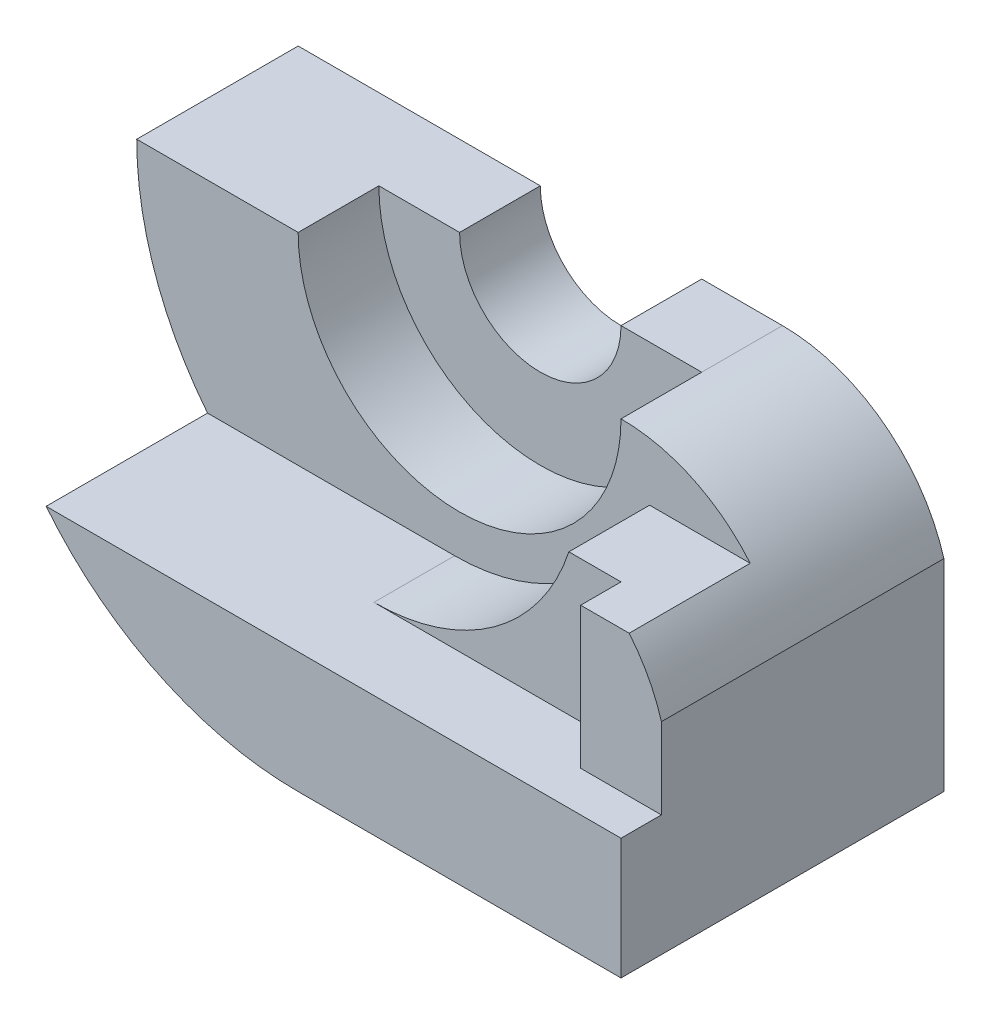
ISO-10303-21;
HEADER;
FILE_DESCRIPTION(('STEP AP214'),'2;1');
FILE_NAME('part.step','',(''),(''),'','','');
FILE_SCHEMA(('AUTOMOTIVE_DESIGN { 1 0 10303 214 1 1 1 1 }'));
ENDSEC;
DATA;
#1=APPLICATION_CONTEXT('core data for automotive mechanical design processes');
#2=APPLICATION_PROTOCOL_DEFINITION('international standard','automotive_design',2000,#1);
#3=PRODUCT_CONTEXT('',#1,'mechanical');
#4=PRODUCT('Part','Part','',(#3));
#5=PRODUCT_RELATED_PRODUCT_CATEGORY('part','',(#4));
#6=PRODUCT_DEFINITION_FORMATION('','',#4);
#7=PRODUCT_DEFINITION_CONTEXT('part definition',#1,'design');
#8=PRODUCT_DEFINITION('design','',#6,#7);
#9=PRODUCT_DEFINITION_SHAPE('','',#8);
#10=(LENGTH_UNIT() NAMED_UNIT(*) SI_UNIT(.MILLI.,.METRE.));
#11=(NAMED_UNIT(*) PLANE_ANGLE_UNIT() SI_UNIT($,.RADIAN.));
#12=(NAMED_UNIT(*) SI_UNIT($,.STERADIAN.) SOLID_ANGLE_UNIT());
#13=UNCERTAINTY_MEASURE_WITH_UNIT(LENGTH_MEASURE(1.E-05),#10,'distance_accuracy_value','');
#14=(GEOMETRIC_REPRESENTATION_CONTEXT(3) GLOBAL_UNCERTAINTY_ASSIGNED_CONTEXT((#13)) GLOBAL_UNIT_ASSIGNED_CONTEXT((#10,
#11,#12)) REPRESENTATION_CONTEXT('',''));
#15=CARTESIAN_POINT('',(0.,0.,0.));
#16=DIRECTION('',(0.,0.,1.));
#17=DIRECTION('',(1.,0.,0.));
#18=AXIS2_PLACEMENT_3D('',#15,#16,#17);
#19=CARTESIAN_POINT('',(0.,0.,80.));
#20=DIRECTION('',(0.,0.,-1.));
#21=DIRECTION('',(-1.,0.,0.));
#22=AXIS2_PLACEMENT_3D('',#19,#20,#21);
#23=CYLINDRICAL_SURFACE('',#22,40.);
#24=CARTESIAN_POINT('',(0.,0.,40.));
#25=DIRECTION('',(0.,0.,1.));
#26=DIRECTION('',(1.,0.,0.));
#27=AXIS2_PLACEMENT_3D('',#24,#25,#26);
#28=CIRCLE('',#27,40.);
#29=CARTESIAN_POINT('',(40.,0.,40.));
#30=VERTEX_POINT('',#29);
#31=CARTESIAN_POINT('',(-40.,0.,40.));
#32=VERTEX_POINT('',#31);
#33=EDGE_CURVE('E175',#30,#32,#28,.F.);
#34=ORIENTED_EDGE('',*,*,#33,.F.);
#35=DIRECTION('',(0.,0.,-1.));
#36=VECTOR('',#35,1.);
#37=CARTESIAN_POINT('',(40.,0.,80.));
#38=LINE('',#37,#36);
#39=CARTESIAN_POINT('',(40.,0.,20.));
#40=VERTEX_POINT('',#39);
#41=EDGE_CURVE('E234',#30,#40,#38,.T.);
#42=ORIENTED_EDGE('',*,*,#41,.T.);
#43=CARTESIAN_POINT('',(0.,0.,20.));
#44=DIRECTION('',(0.,0.,-1.));
#45=DIRECTION('',(-1.,0.,0.));
#46=AXIS2_PLACEMENT_3D('',#43,#44,#45);
#47=CIRCLE('',#46,40.);
#48=CARTESIAN_POINT('',(-40.,0.,20.));
#49=VERTEX_POINT('',#48);
#50=EDGE_CURVE('E191',#49,#40,#47,.F.);
#51=ORIENTED_EDGE('',*,*,#50,.F.);
#52=DIRECTION('',(0.,0.,-1.));
#53=VECTOR('',#52,1.);
#54=CARTESIAN_POINT('',(-40.,0.,80.));
#55=LINE('',#54,#53);
#56=EDGE_CURVE('E232',#32,#49,#55,.T.);
#57=ORIENTED_EDGE('',*,*,#56,.F.);
#58=EDGE_LOOP('',(#34,#42,#51,#57));
#59=FACE_BOUND('',#58,.T.);
#60=ADVANCED_FACE('F34',(#59),#23,.F.);
#61=CARTESIAN_POINT('',(40.,-41.6666666666667,80.));
#62=DIRECTION('',(0.,0.,-1.));
#63=DIRECTION('',(-1.,0.,0.));
#64=AXIS2_PLACEMENT_3D('',#61,#62,#63);
#65=CYLINDRICAL_SURFACE('',#64,41.6666666666667);
#66=DIRECTION('',(0.,0.,-1.));
#67=VECTOR('',#66,1.);
#68=CARTESIAN_POINT('',(72.0156211871643,-15.,80.));
#69=LINE('',#68,#67);
#70=CARTESIAN_POINT('',(72.0156211871643,-15.,70.));
#71=VERTEX_POINT('',#70);
#72=CARTESIAN_POINT('',(72.0156211871643,-15.,40.));
#73=VERTEX_POINT('',#72);
#74=EDGE_CURVE('E165',#71,#73,#69,.T.);
#75=ORIENTED_EDGE('',*,*,#74,.F.);
#76=CARTESIAN_POINT('',(40.,-41.6666666666667,70.));
#77=DIRECTION('',(0.,0.,1.));
#78=DIRECTION('',(1.,0.,0.));
#79=AXIS2_PLACEMENT_3D('',#76,#77,#78);
#80=CIRCLE('',#79,41.6666666666667);
#81=CARTESIAN_POINT('',(80.,-30.,70.));
#82=VERTEX_POINT('',#81);
#83=EDGE_CURVE('E260',#82,#71,#80,.T.);
#84=ORIENTED_EDGE('',*,*,#83,.F.);
#85=DIRECTION('',(0.,0.,-1.));
#86=VECTOR('',#85,1.);
#87=CARTESIAN_POINT('',(80.,-30.,80.));
#88=LINE('',#87,#86);
#89=CARTESIAN_POINT('',(80.,-30.,0.));
#90=VERTEX_POINT('',#89);
#91=EDGE_CURVE('E236',#82,#90,#88,.T.);
#92=ORIENTED_EDGE('',*,*,#91,.T.);
#93=CARTESIAN_POINT('',(40.,-41.6666666666667,0.));
#94=DIRECTION('',(0.,0.,1.));
#95=DIRECTION('',(1.,0.,0.));
#96=AXIS2_PLACEMENT_3D('',#93,#94,#95);
#97=CIRCLE('',#96,41.6666666666667);
#98=CARTESIAN_POINT('',(40.,0.,0.));
#99=VERTEX_POINT('',#98);
#100=EDGE_CURVE('E218',#90,#99,#97,.T.);
#101=ORIENTED_EDGE('',*,*,#100,.T.);
#102=DIRECTION('',(0.,0.,-1.));
#103=VECTOR('',#102,1.);
#104=CARTESIAN_POINT('',(40.,0.,20.));
#105=LINE('',#104,#103);
#106=EDGE_CURVE('E199',#40,#99,#105,.T.);
#107=ORIENTED_EDGE('',*,*,#106,.F.);
#108=ORIENTED_EDGE('',*,*,#41,.F.);
#109=CARTESIAN_POINT('',(40.,-41.6666666666667,40.));
#110=DIRECTION('',(0.,0.,1.));
#111=DIRECTION('',(1.,0.,0.));
#112=AXIS2_PLACEMENT_3D('',#109,#110,#111);
#113=CIRCLE('',#112,41.6666666666667);
#114=EDGE_CURVE('E168',#73,#30,#113,.T.);
#115=ORIENTED_EDGE('',*,*,#114,.F.);
#116=EDGE_LOOP('',(#75,#84,#92,#101,#107,#108,#115));
#117=FACE_BOUND('',#116,.T.);
#118=ADVANCED_FACE('F291',(#117),#65,.T.);
#119=CARTESIAN_POINT('',(0.,0.,80.));
#120=DIRECTION('',(0.,1.,0.));
#121=DIRECTION('',(0.,0.,1.));
#122=AXIS2_PLACEMENT_3D('',#119,#120,#121);
#123=PLANE('',#122);
#124=DIRECTION('',(0.,0.,-1.));
#125=VECTOR('',#124,1.);
#126=CARTESIAN_POINT('',(-80.,0.,80.));
#127=LINE('',#126,#125);
#128=CARTESIAN_POINT('',(-80.,0.,40.));
#129=VERTEX_POINT('',#128);
#130=CARTESIAN_POINT('',(-80.,0.,0.));
#131=VERTEX_POINT('',#130);
#132=EDGE_CURVE('E230',#129,#131,#127,.T.);
#133=ORIENTED_EDGE('',*,*,#132,.F.);
#134=DIRECTION('',(-1.,0.,0.));
#135=VECTOR('',#134,1.);
#136=CARTESIAN_POINT('',(142.,0.,40.));
#137=LINE('',#136,#135);
#138=EDGE_CURVE('E166',#32,#129,#137,.T.);
#139=ORIENTED_EDGE('',*,*,#138,.F.);
#140=ORIENTED_EDGE('',*,*,#56,.T.);
#141=DIRECTION('',(-1.,0.,0.));
#142=VECTOR('',#141,1.);
#143=CARTESIAN_POINT('',(0.,0.,20.));
#144=LINE('',#143,#142);
#145=CARTESIAN_POINT('',(-20.,0.,20.));
#146=VERTEX_POINT('',#145);
#147=EDGE_CURVE('E181',#146,#49,#144,.T.);
#148=ORIENTED_EDGE('',*,*,#147,.F.);
#149=DIRECTION('',(0.,0.,-1.));
#150=VECTOR('',#149,1.);
#151=CARTESIAN_POINT('',(-20.,0.,20.));
#152=LINE('',#151,#150);
#153=CARTESIAN_POINT('',(-20.,0.,0.));
#154=VERTEX_POINT('',#153);
#155=EDGE_CURVE('E194',#146,#154,#152,.T.);
#156=ORIENTED_EDGE('',*,*,#155,.T.);
#157=DIRECTION('',(1.,0.,0.));
#158=VECTOR('',#157,1.);
#159=CARTESIAN_POINT('',(0.,0.,0.));
#160=LINE('',#159,#158);
#161=EDGE_CURVE('E220',#131,#154,#160,.T.);
#162=ORIENTED_EDGE('',*,*,#161,.F.);
#163=EDGE_LOOP('',(#133,#139,#140,#148,#156,#162));
#164=FACE_BOUND('',#163,.T.);
#165=ADVANCED_FACE('F300',(#164),#123,.T.);
#166=CARTESIAN_POINT('',(0.,0.,80.));
#167=DIRECTION('',(0.,0.,-1.));
#168=DIRECTION('',(-1.,0.,0.));
#169=AXIS2_PLACEMENT_3D('',#166,#167,#168);
#170=CYLINDRICAL_SURFACE('',#169,80.);
#171=DIRECTION('',(0.,0.,-1.));
#172=VECTOR('',#171,1.);
#173=CARTESIAN_POINT('',(-62.449979983984,-50.,80.));
#174=LINE('',#173,#172);
#175=CARTESIAN_POINT('',(-62.449979983984,-50.,40.));
#176=VERTEX_POINT('',#175);
#177=CARTESIAN_POINT('',(-62.449979983984,-50.,80.));
#178=VERTEX_POINT('',#177);
#179=EDGE_CURVE('E177',#176,#178,#174,.F.);
#180=ORIENTED_EDGE('',*,*,#179,.F.);
#181=CARTESIAN_POINT('',(0.,0.,40.));
#182=DIRECTION('',(0.,0.,1.));
#183=DIRECTION('',(1.,0.,0.));
#184=AXIS2_PLACEMENT_3D('',#181,#182,#183);
#185=CIRCLE('',#184,80.);
#186=EDGE_CURVE('E11',#129,#176,#185,.T.);
#187=ORIENTED_EDGE('',*,*,#186,.F.);
#188=ORIENTED_EDGE('',*,*,#132,.T.);
#189=CARTESIAN_POINT('',(0.,0.,0.));
#190=DIRECTION('',(0.,0.,1.));
#191=DIRECTION('',(1.,0.,0.));
#192=AXIS2_PLACEMENT_3D('',#189,#190,#191);
#193=CIRCLE('',#192,80.);
#194=CARTESIAN_POINT('',(0.,-80.,0.));
#195=VERTEX_POINT('',#194);
#196=EDGE_CURVE('E222',#131,#195,#193,.T.);
#197=ORIENTED_EDGE('',*,*,#196,.T.);
#198=DIRECTION('',(0.,0.,-1.));
#199=VECTOR('',#198,1.);
#200=CARTESIAN_POINT('',(0.,-80.,80.));
#201=LINE('',#200,#199);
#202=CARTESIAN_POINT('',(0.,-80.,80.));
#203=VERTEX_POINT('',#202);
#204=EDGE_CURVE('E227',#203,#195,#201,.T.);
#205=ORIENTED_EDGE('',*,*,#204,.F.);
#206=CARTESIAN_POINT('',(0.,0.,80.));
#207=DIRECTION('',(0.,0.,1.));
#208=DIRECTION('',(1.,0.,0.));
#209=AXIS2_PLACEMENT_3D('',#206,#207,#208);
#210=CIRCLE('',#209,80.);
#211=EDGE_CURVE('E210',#178,#203,#210,.T.);
#212=ORIENTED_EDGE('',*,*,#211,.F.);
#213=EDGE_LOOP('',(#180,#187,#188,#197,#205,#212));
#214=FACE_BOUND('',#213,.T.);
#215=ADVANCED_FACE('F244',(#214),#170,.T.);
#216=CARTESIAN_POINT('',(80.,0.,80.));
#217=DIRECTION('',(-1.,0.,0.));
#218=DIRECTION('',(0.,0.,1.));
#219=AXIS2_PLACEMENT_3D('',#216,#217,#218);
#220=PLANE('',#219);
#221=ORIENTED_EDGE('',*,*,#91,.F.);
#222=DIRECTION('',(0.,1.,0.));
#223=VECTOR('',#222,1.);
#224=CARTESIAN_POINT('',(80.,0.,70.));
#225=LINE('',#224,#223);
#226=CARTESIAN_POINT('',(80.,-50.,70.));
#227=VERTEX_POINT('',#226);
#228=EDGE_CURVE('E256',#227,#82,#225,.T.);
#229=ORIENTED_EDGE('',*,*,#228,.F.);
#230=DIRECTION('',(0.,0.,-1.));
#231=VECTOR('',#230,1.);
#232=CARTESIAN_POINT('',(80.,-50.,80.));
#233=LINE('',#232,#231);
#234=CARTESIAN_POINT('',(80.,-50.,80.));
#235=VERTEX_POINT('',#234);
#236=EDGE_CURVE('E54',#235,#227,#233,.T.);
#237=ORIENTED_EDGE('',*,*,#236,.F.);
#238=DIRECTION('',(0.,1.,0.));
#239=VECTOR('',#238,1.);
#240=CARTESIAN_POINT('',(80.,0.,80.));
#241=LINE('',#240,#239);
#242=CARTESIAN_POINT('',(80.,-80.,80.));
#243=VERTEX_POINT('',#242);
#244=EDGE_CURVE('E207',#243,#235,#241,.T.);
#245=ORIENTED_EDGE('',*,*,#244,.F.);
#246=DIRECTION('',(0.,0.,-1.));
#247=VECTOR('',#246,1.);
#248=CARTESIAN_POINT('',(80.,-80.,80.));
#249=LINE('',#248,#247);
#250=CARTESIAN_POINT('',(80.,-80.,0.));
#251=VERTEX_POINT('',#250);
#252=EDGE_CURVE('E215',#243,#251,#249,.T.);
#253=ORIENTED_EDGE('',*,*,#252,.T.);
#254=DIRECTION('',(0.,1.,0.));
#255=VECTOR('',#254,1.);
#256=CARTESIAN_POINT('',(80.,0.,0.));
#257=LINE('',#256,#255);
#258=EDGE_CURVE('E202',#251,#90,#257,.T.);
#259=ORIENTED_EDGE('',*,*,#258,.T.);
#260=EDGE_LOOP('',(#221,#229,#237,#245,#253,#259));
#261=FACE_BOUND('',#260,.T.);
#262=ADVANCED_FACE('F36',(#261),#220,.F.);
#263=CARTESIAN_POINT('',(0.,0.,80.));
#264=DIRECTION('',(0.,0.,1.));
#265=DIRECTION('',(1.,0.,0.));
#266=AXIS2_PLACEMENT_3D('',#263,#264,#265);
#267=PLANE('',#266);
#268=ORIENTED_EDGE('',*,*,#244,.T.);
#269=DIRECTION('',(-1.,0.,0.));
#270=VECTOR('',#269,1.);
#271=CARTESIAN_POINT('',(0.,-50.,80.));
#272=LINE('',#271,#270);
#273=EDGE_CURVE('E42',#235,#178,#272,.T.);
#274=ORIENTED_EDGE('',*,*,#273,.T.);
#275=ORIENTED_EDGE('',*,*,#211,.T.);
#276=DIRECTION('',(1.,0.,0.));
#277=VECTOR('',#276,1.);
#278=CARTESIAN_POINT('',(0.,-80.,80.));
#279=LINE('',#278,#277);
#280=EDGE_CURVE('E213',#203,#243,#279,.T.);
#281=ORIENTED_EDGE('',*,*,#280,.T.);
#282=EDGE_LOOP('',(#268,#274,#275,#281));
#283=FACE_BOUND('',#282,.T.);
#284=ADVANCED_FACE('F240',(#283),#267,.T.);
#285=CARTESIAN_POINT('',(0.,-80.,80.));
#286=DIRECTION('',(0.,1.,0.));
#287=DIRECTION('',(0.,0.,1.));
#288=AXIS2_PLACEMENT_3D('',#285,#286,#287);
#289=PLANE('',#288);
#290=DIRECTION('',(1.,0.,0.));
#291=VECTOR('',#290,1.);
#292=CARTESIAN_POINT('',(0.,-80.,0.));
#293=LINE('',#292,#291);
#294=EDGE_CURVE('E211',#195,#251,#293,.T.);
#295=ORIENTED_EDGE('',*,*,#294,.T.);
#296=ORIENTED_EDGE('',*,*,#252,.F.);
#297=ORIENTED_EDGE('',*,*,#280,.F.);
#298=ORIENTED_EDGE('',*,*,#204,.T.);
#299=EDGE_LOOP('',(#295,#296,#297,#298));
#300=FACE_BOUND('',#299,.T.);
#301=ADVANCED_FACE('F251',(#300),#289,.F.);
#302=CARTESIAN_POINT('',(0.,0.,0.));
#303=DIRECTION('',(0.,0.,1.));
#304=DIRECTION('',(1.,0.,0.));
#305=AXIS2_PLACEMENT_3D('',#302,#303,#304);
#306=PLANE('',#305);
#307=ORIENTED_EDGE('',*,*,#258,.F.);
#308=ORIENTED_EDGE('',*,*,#294,.F.);
#309=ORIENTED_EDGE('',*,*,#196,.F.);
#310=ORIENTED_EDGE('',*,*,#161,.T.);
#311=CARTESIAN_POINT('',(0.,0.,0.));
#312=DIRECTION('',(0.,0.,-1.));
#313=DIRECTION('',(-1.,0.,0.));
#314=AXIS2_PLACEMENT_3D('',#311,#312,#313);
#315=CIRCLE('',#314,20.);
#316=CARTESIAN_POINT('',(20.,0.,0.));
#317=VERTEX_POINT('',#316);
#318=EDGE_CURVE('E180',#154,#317,#315,.F.);
#319=ORIENTED_EDGE('',*,*,#318,.T.);
#320=DIRECTION('',(1.,0.,0.));
#321=VECTOR('',#320,1.);
#322=CARTESIAN_POINT('',(0.,0.,0.));
#323=LINE('',#322,#321);
#324=EDGE_CURVE('E185',#317,#99,#323,.T.);
#325=ORIENTED_EDGE('',*,*,#324,.T.);
#326=ORIENTED_EDGE('',*,*,#100,.F.);
#327=EDGE_LOOP('',(#307,#308,#309,#310,#319,#325,#326));
#328=FACE_BOUND('',#327,.T.);
#329=ADVANCED_FACE('F313',(#328),#306,.F.);
#330=CARTESIAN_POINT('',(0.,0.,20.));
#331=DIRECTION('',(0.,1.,0.));
#332=DIRECTION('',(-1.,0.,0.));
#333=AXIS2_PLACEMENT_3D('',#330,#331,#332);
#334=PLANE('',#333);
#335=ORIENTED_EDGE('',*,*,#324,.F.);
#336=DIRECTION('',(0.,0.,-1.));
#337=VECTOR('',#336,1.);
#338=CARTESIAN_POINT('',(20.,0.,20.));
#339=LINE('',#338,#337);
#340=CARTESIAN_POINT('',(20.,0.,20.));
#341=VERTEX_POINT('',#340);
#342=EDGE_CURVE('E203',#341,#317,#339,.T.);
#343=ORIENTED_EDGE('',*,*,#342,.F.);
#344=DIRECTION('',(1.,0.,0.));
#345=VECTOR('',#344,1.);
#346=CARTESIAN_POINT('',(0.,0.,20.));
#347=LINE('',#346,#345);
#348=EDGE_CURVE('E188',#341,#40,#347,.T.);
#349=ORIENTED_EDGE('',*,*,#348,.T.);
#350=ORIENTED_EDGE('',*,*,#106,.T.);
#351=EDGE_LOOP('',(#335,#343,#349,#350));
#352=FACE_BOUND('',#351,.T.);
#353=ADVANCED_FACE('F315',(#352),#334,.T.);
#354=CARTESIAN_POINT('',(0.,0.,20.));
#355=DIRECTION('',(0.,0.,-1.));
#356=DIRECTION('',(-1.,0.,0.));
#357=AXIS2_PLACEMENT_3D('',#354,#355,#356);
#358=CYLINDRICAL_SURFACE('',#357,20.);
#359=ORIENTED_EDGE('',*,*,#318,.F.);
#360=ORIENTED_EDGE('',*,*,#155,.F.);
#361=CARTESIAN_POINT('',(0.,0.,20.));
#362=DIRECTION('',(0.,0.,-1.));
#363=DIRECTION('',(-1.,0.,0.));
#364=AXIS2_PLACEMENT_3D('',#361,#362,#363);
#365=CIRCLE('',#364,20.);
#366=EDGE_CURVE('E184',#146,#341,#365,.F.);
#367=ORIENTED_EDGE('',*,*,#366,.T.);
#368=ORIENTED_EDGE('',*,*,#342,.T.);
#369=EDGE_LOOP('',(#359,#360,#367,#368));
#370=FACE_BOUND('',#369,.T.);
#371=ADVANCED_FACE('F310',(#370),#358,.F.);
#372=CARTESIAN_POINT('',(0.,0.,20.));
#373=DIRECTION('',(0.,0.,-1.));
#374=DIRECTION('',(-1.,0.,0.));
#375=AXIS2_PLACEMENT_3D('',#372,#373,#374);
#376=PLANE('',#375);
#377=ORIENTED_EDGE('',*,*,#147,.T.);
#378=ORIENTED_EDGE('',*,*,#50,.T.);
#379=ORIENTED_EDGE('',*,*,#348,.F.);
#380=ORIENTED_EDGE('',*,*,#366,.F.);
#381=EDGE_LOOP('',(#377,#378,#379,#380));
#382=FACE_BOUND('',#381,.T.);
#383=ADVANCED_FACE('F307',(#382),#376,.F.);
#384=CARTESIAN_POINT('',(142.,-50.,80.));
#385=DIRECTION('',(0.,1.,0.));
#386=DIRECTION('',(0.,0.,1.));
#387=AXIS2_PLACEMENT_3D('',#384,#385,#386);
#388=PLANE('',#387);
#389=DIRECTION('',(1.,0.,0.));
#390=VECTOR('',#389,1.);
#391=CARTESIAN_POINT('',(-62.449979983984,-50.,40.));
#392=LINE('',#391,#390);
#393=CARTESIAN_POINT('',(-1.22498999199199,-50.,40.));
#394=VERTEX_POINT('',#393);
#395=EDGE_CURVE('E153',#176,#394,#392,.T.);
#396=ORIENTED_EDGE('',*,*,#395,.F.);
#397=ORIENTED_EDGE('',*,*,#179,.T.);
#398=ORIENTED_EDGE('',*,*,#273,.F.);
#399=ORIENTED_EDGE('',*,*,#236,.T.);
#400=DIRECTION('',(1.,0.,0.));
#401=VECTOR('',#400,1.);
#402=CARTESIAN_POINT('',(0.,-50.,70.));
#403=LINE('',#402,#401);
#404=CARTESIAN_POINT('',(60.,-50.,70.));
#405=VERTEX_POINT('',#404);
#406=EDGE_CURVE('E49',#405,#227,#403,.T.);
#407=ORIENTED_EDGE('',*,*,#406,.F.);
#408=DIRECTION('',(0.,0.,-1.));
#409=VECTOR('',#408,1.);
#410=CARTESIAN_POINT('',(60.,-50.,70.));
#411=LINE('',#410,#409);
#412=CARTESIAN_POINT('',(60.,-50.,60.));
#413=VERTEX_POINT('',#412);
#414=EDGE_CURVE('E275',#405,#413,#411,.T.);
#415=ORIENTED_EDGE('',*,*,#414,.T.);
#416=DIRECTION('',(1.,0.,0.));
#417=VECTOR('',#416,1.);
#418=CARTESIAN_POINT('',(0.,-50.,60.));
#419=LINE('',#418,#417);
#420=CARTESIAN_POINT('',(-1.22498999199199,-50.,60.));
#421=VERTEX_POINT('',#420);
#422=EDGE_CURVE('E170',#421,#413,#419,.T.);
#423=ORIENTED_EDGE('',*,*,#422,.F.);
#424=DIRECTION('',(0.,0.,1.));
#425=VECTOR('',#424,1.);
#426=CARTESIAN_POINT('',(-1.22498999199199,-50.,40.));
#427=LINE('',#426,#425);
#428=EDGE_CURVE('E152',#394,#421,#427,.T.);
#429=ORIENTED_EDGE('',*,*,#428,.F.);
#430=EDGE_LOOP('',(#396,#397,#398,#399,#407,#415,#423,#429));
#431=FACE_BOUND('',#430,.T.);
#432=ADVANCED_FACE('F421',(#431),#388,.T.);
#433=CARTESIAN_POINT('',(142.,0.,40.));
#434=DIRECTION('',(0.,0.,1.));
#435=DIRECTION('',(1.,0.,0.));
#436=AXIS2_PLACEMENT_3D('',#433,#434,#435);
#437=PLANE('',#436);
#438=ORIENTED_EDGE('',*,*,#33,.T.);
#439=ORIENTED_EDGE('',*,*,#138,.T.);
#440=ORIENTED_EDGE('',*,*,#186,.T.);
#441=ORIENTED_EDGE('',*,*,#395,.T.);
#442=CARTESIAN_POINT('',(-1.22498999199199,0.835256261186697,40.));
#443=DIRECTION('',(0.,0.,1.));
#444=DIRECTION('',(1.,0.,0.));
#445=AXIS2_PLACEMENT_3D('',#442,#443,#444);
#446=CIRCLE('',#445,50.8352562611867);
#447=CARTESIAN_POINT('',(47.0809924354783,-15.,40.));
#448=VERTEX_POINT('',#447);
#449=EDGE_CURVE('E145',#394,#448,#446,.T.);
#450=ORIENTED_EDGE('',*,*,#449,.T.);
#451=DIRECTION('',(-1.,0.,0.));
#452=VECTOR('',#451,1.);
#453=CARTESIAN_POINT('',(142.,-15.,40.));
#454=LINE('',#453,#452);
#455=EDGE_CURVE('E159',#73,#448,#454,.T.);
#456=ORIENTED_EDGE('',*,*,#455,.F.);
#457=ORIENTED_EDGE('',*,*,#114,.T.);
#458=EDGE_LOOP('',(#438,#439,#440,#441,#450,#456,#457));
#459=FACE_BOUND('',#458,.T.);
#460=ADVANCED_FACE('F157',(#459),#437,.T.);
#461=CARTESIAN_POINT('',(142.,-15.,70.));
#462=DIRECTION('',(0.,1.,0.));
#463=DIRECTION('',(0.,0.,1.));
#464=AXIS2_PLACEMENT_3D('',#461,#462,#463);
#465=PLANE('',#464);
#466=DIRECTION('',(0.,0.,1.));
#467=VECTOR('',#466,1.);
#468=CARTESIAN_POINT('',(47.0809924354783,-15.,40.));
#469=LINE('',#468,#467);
#470=CARTESIAN_POINT('',(47.0809924354783,-15.,60.));
#471=VERTEX_POINT('',#470);
#472=EDGE_CURVE('E142',#448,#471,#469,.T.);
#473=ORIENTED_EDGE('',*,*,#472,.T.);
#474=DIRECTION('',(-1.,0.,0.));
#475=VECTOR('',#474,1.);
#476=CARTESIAN_POINT('',(0.,-15.,60.));
#477=LINE('',#476,#475);
#478=CARTESIAN_POINT('',(60.,-15.,60.));
#479=VERTEX_POINT('',#478);
#480=EDGE_CURVE('E278',#479,#471,#477,.T.);
#481=ORIENTED_EDGE('',*,*,#480,.F.);
#482=DIRECTION('',(0.,0.,-1.));
#483=VECTOR('',#482,1.);
#484=CARTESIAN_POINT('',(60.,-15.,70.));
#485=LINE('',#484,#483);
#486=CARTESIAN_POINT('',(60.,-15.,70.));
#487=VERTEX_POINT('',#486);
#488=EDGE_CURVE('E269',#487,#479,#485,.T.);
#489=ORIENTED_EDGE('',*,*,#488,.F.);
#490=DIRECTION('',(-1.,0.,0.));
#491=VECTOR('',#490,1.);
#492=CARTESIAN_POINT('',(0.,-15.,70.));
#493=LINE('',#492,#491);
#494=EDGE_CURVE('E262',#71,#487,#493,.T.);
#495=ORIENTED_EDGE('',*,*,#494,.F.);
#496=ORIENTED_EDGE('',*,*,#74,.T.);
#497=ORIENTED_EDGE('',*,*,#455,.T.);
#498=EDGE_LOOP('',(#473,#481,#489,#495,#496,#497));
#499=FACE_BOUND('',#498,.T.);
#500=ADVANCED_FACE('F163',(#499),#465,.T.);
#501=CARTESIAN_POINT('',(0.,0.,60.));
#502=DIRECTION('',(0.,0.,1.));
#503=DIRECTION('',(1.,0.,0.));
#504=AXIS2_PLACEMENT_3D('',#501,#502,#503);
#505=PLANE('',#504);
#506=DIRECTION('',(0.,1.,0.));
#507=VECTOR('',#506,1.);
#508=CARTESIAN_POINT('',(60.,0.,60.));
#509=LINE('',#508,#507);
#510=EDGE_CURVE('E270',#413,#479,#509,.T.);
#511=ORIENTED_EDGE('',*,*,#510,.T.);
#512=ORIENTED_EDGE('',*,*,#480,.T.);
#513=CARTESIAN_POINT('',(-1.22498999199199,0.835256261186697,60.));
#514=DIRECTION('',(0.,0.,-1.));
#515=DIRECTION('',(1.,0.,0.));
#516=AXIS2_PLACEMENT_3D('',#513,#514,#515);
#517=CIRCLE('',#516,50.8352562611867);
#518=EDGE_CURVE('E148',#471,#421,#517,.T.);
#519=ORIENTED_EDGE('',*,*,#518,.T.);
#520=ORIENTED_EDGE('',*,*,#422,.T.);
#521=EDGE_LOOP('',(#511,#512,#519,#520));
#522=FACE_BOUND('',#521,.T.);
#523=ADVANCED_FACE('F283',(#522),#505,.T.);
#524=CARTESIAN_POINT('',(60.,0.,70.));
#525=DIRECTION('',(-1.,0.,0.));
#526=DIRECTION('',(0.,0.,1.));
#527=AXIS2_PLACEMENT_3D('',#524,#525,#526);
#528=PLANE('',#527);
#529=ORIENTED_EDGE('',*,*,#510,.F.);
#530=ORIENTED_EDGE('',*,*,#414,.F.);
#531=DIRECTION('',(0.,1.,0.));
#532=VECTOR('',#531,1.);
#533=CARTESIAN_POINT('',(60.,0.,70.));
#534=LINE('',#533,#532);
#535=EDGE_CURVE('E264',#405,#487,#534,.T.);
#536=ORIENTED_EDGE('',*,*,#535,.T.);
#537=ORIENTED_EDGE('',*,*,#488,.T.);
#538=EDGE_LOOP('',(#529,#530,#536,#537));
#539=FACE_BOUND('',#538,.T.);
#540=ADVANCED_FACE('F285',(#539),#528,.T.);
#541=CARTESIAN_POINT('',(0.,0.,70.));
#542=DIRECTION('',(0.,0.,1.));
#543=DIRECTION('',(1.,0.,0.));
#544=AXIS2_PLACEMENT_3D('',#541,#542,#543);
#545=PLANE('',#544);
#546=ORIENTED_EDGE('',*,*,#535,.F.);
#547=ORIENTED_EDGE('',*,*,#406,.T.);
#548=ORIENTED_EDGE('',*,*,#228,.T.);
#549=ORIENTED_EDGE('',*,*,#83,.T.);
#550=ORIENTED_EDGE('',*,*,#494,.T.);
#551=EDGE_LOOP('',(#546,#547,#548,#549,#550));
#552=FACE_BOUND('',#551,.T.);
#553=ADVANCED_FACE('F289',(#552),#545,.T.);
#554=CARTESIAN_POINT('',(-1.22498999199199,0.835256261186697,40.));
#555=DIRECTION('',(0.,0.,1.));
#556=DIRECTION('',(1.,0.,0.));
#557=AXIS2_PLACEMENT_3D('',#554,#555,#556);
#558=CYLINDRICAL_SURFACE('',#557,50.8352562611867);
#559=ORIENTED_EDGE('',*,*,#518,.F.);
#560=ORIENTED_EDGE('',*,*,#472,.F.);
#561=ORIENTED_EDGE('',*,*,#449,.F.);
#562=ORIENTED_EDGE('',*,*,#428,.T.);
#563=EDGE_LOOP('',(#559,#560,#561,#562));
#564=FACE_BOUND('',#563,.T.);
#565=ADVANCED_FACE('F144',(#564),#558,.F.);
#566=CLOSED_SHELL('',(#60,#118,#165,#215,#262,#284,#301,#329,#353,#371,#383,#432,#460,#500,#523,
#540,#553,#565));
#567=MANIFOLD_SOLID_BREP('B2',#566);
#568=ADVANCED_BREP_SHAPE_REPRESENTATION('',(#18,#567),#14);
#569=SHAPE_DEFINITION_REPRESENTATION(#9,#568);
ENDSEC;
END-ISO-10303-21;
